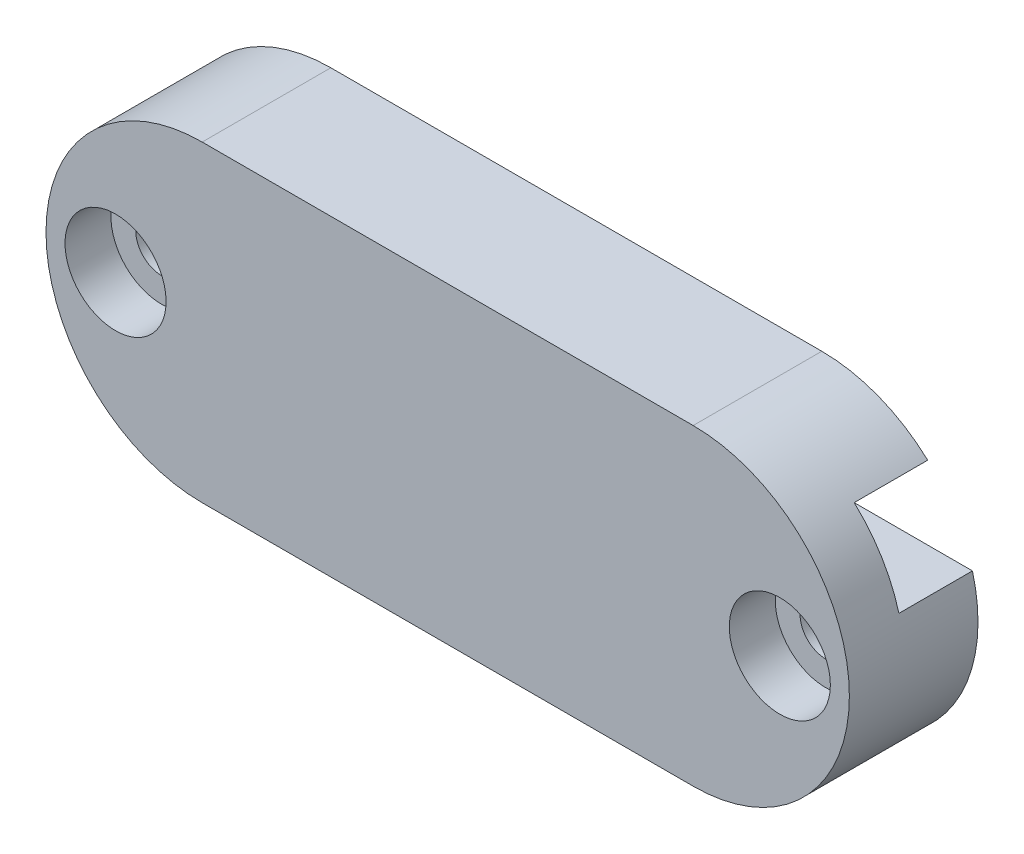
ISO-10303-21;
HEADER;
FILE_DESCRIPTION(('STEP AP214'),'2;1');
FILE_NAME('part.step','',(''),(''),'','','');
FILE_SCHEMA(('AUTOMOTIVE_DESIGN { 1 0 10303 214 1 1 1 1 }'));
ENDSEC;
DATA;
#1=APPLICATION_CONTEXT('core data for automotive mechanical design processes');
#2=APPLICATION_PROTOCOL_DEFINITION('international standard','automotive_design',2000,#1);
#3=PRODUCT_CONTEXT('',#1,'mechanical');
#4=PRODUCT('Part','Part','',(#3));
#5=PRODUCT_RELATED_PRODUCT_CATEGORY('part','',(#4));
#6=PRODUCT_DEFINITION_FORMATION('','',#4);
#7=PRODUCT_DEFINITION_CONTEXT('part definition',#1,'design');
#8=PRODUCT_DEFINITION('design','',#6,#7);
#9=PRODUCT_DEFINITION_SHAPE('','',#8);
#10=(LENGTH_UNIT() NAMED_UNIT(*) SI_UNIT(.MILLI.,.METRE.));
#11=(NAMED_UNIT(*) PLANE_ANGLE_UNIT() SI_UNIT($,.RADIAN.));
#12=(NAMED_UNIT(*) SI_UNIT($,.STERADIAN.) SOLID_ANGLE_UNIT());
#13=UNCERTAINTY_MEASURE_WITH_UNIT(LENGTH_MEASURE(1.E-05),#10,'distance_accuracy_value','');
#14=(GEOMETRIC_REPRESENTATION_CONTEXT(3) GLOBAL_UNCERTAINTY_ASSIGNED_CONTEXT((#13)) GLOBAL_UNIT_ASSIGNED_CONTEXT((#10,
#11,#12)) REPRESENTATION_CONTEXT('',''));
#15=CARTESIAN_POINT('',(0.,0.,0.));
#16=DIRECTION('',(0.,0.,1.));
#17=DIRECTION('',(1.,0.,0.));
#18=AXIS2_PLACEMENT_3D('',#15,#16,#17);
#19=CARTESIAN_POINT('',(-18.075,0.,7.));
#20=DIRECTION('',(0.,0.,-1.));
#21=DIRECTION('',(-1.,0.,0.));
#22=AXIS2_PLACEMENT_3D('',#19,#20,#21);
#23=CYLINDRICAL_SURFACE('',#22,1.4);
#24=CARTESIAN_POINT('',(-18.075,0.,0.));
#25=DIRECTION('',(0.,0.,1.));
#26=DIRECTION('',(1.,0.,0.));
#27=AXIS2_PLACEMENT_3D('',#24,#25,#26);
#28=CIRCLE('',#27,1.4);
#29=CARTESIAN_POINT('',(-16.675,0.,0.));
#30=VERTEX_POINT('',#29);
#31=EDGE_CURVE('E178',#30,#30,#28,.T.);
#32=ORIENTED_EDGE('',*,*,#31,.F.);
#33=EDGE_LOOP('',(#32));
#34=FACE_BOUND('',#33,.T.);
#35=CARTESIAN_POINT('',(-18.075,0.,4.5));
#36=DIRECTION('',(0.,0.,1.));
#37=DIRECTION('',(1.,0.,0.));
#38=AXIS2_PLACEMENT_3D('',#35,#36,#37);
#39=CIRCLE('',#38,1.4);
#40=CARTESIAN_POINT('',(-16.675,0.,4.5));
#41=VERTEX_POINT('',#40);
#42=EDGE_CURVE('E170',#41,#41,#39,.F.);
#43=ORIENTED_EDGE('',*,*,#42,.F.);
#44=EDGE_LOOP('',(#43));
#45=FACE_BOUND('',#44,.T.);
#46=ADVANCED_FACE('F37',(#34,#45),#23,.F.);
#47=CARTESIAN_POINT('',(18.075,0.,7.));
#48=DIRECTION('',(0.,0.,-1.));
#49=DIRECTION('',(-1.,0.,0.));
#50=AXIS2_PLACEMENT_3D('',#47,#48,#49);
#51=CYLINDRICAL_SURFACE('',#50,1.4);
#52=CARTESIAN_POINT('',(18.075,0.,0.));
#53=DIRECTION('',(0.,0.,1.));
#54=DIRECTION('',(1.,0.,0.));
#55=AXIS2_PLACEMENT_3D('',#52,#53,#54);
#56=CIRCLE('',#55,1.4);
#57=CARTESIAN_POINT('',(19.475,0.,0.));
#58=VERTEX_POINT('',#57);
#59=EDGE_CURVE('E127',#58,#58,#56,.T.);
#60=ORIENTED_EDGE('',*,*,#59,.F.);
#61=EDGE_LOOP('',(#60));
#62=FACE_BOUND('',#61,.T.);
#63=CARTESIAN_POINT('',(18.075,0.,4.5));
#64=DIRECTION('',(0.,0.,1.));
#65=DIRECTION('',(1.,0.,0.));
#66=AXIS2_PLACEMENT_3D('',#63,#64,#65);
#67=CIRCLE('',#66,1.4);
#68=CARTESIAN_POINT('',(19.475,0.,4.5));
#69=VERTEX_POINT('',#68);
#70=EDGE_CURVE('E167',#69,#69,#67,.F.);
#71=ORIENTED_EDGE('',*,*,#70,.F.);
#72=EDGE_LOOP('',(#71));
#73=FACE_BOUND('',#72,.T.);
#74=ADVANCED_FACE('F221',(#62,#73),#51,.F.);
#75=CARTESIAN_POINT('',(-13.3594073836164,0.,0.));
#76=DIRECTION('',(0.,0.,1.));
#77=DIRECTION('',(1.,0.,0.));
#78=AXIS2_PLACEMENT_3D('',#75,#76,#77);
#79=PLANE('',#78);
#80=ORIENTED_EDGE('',*,*,#59,.T.);
#81=EDGE_LOOP('',(#80));
#82=FACE_BOUND('',#81,.T.);
#83=ORIENTED_EDGE('',*,*,#31,.T.);
#84=EDGE_LOOP('',(#83));
#85=FACE_BOUND('',#84,.T.);
#86=CARTESIAN_POINT('',(-13.3594073836164,0.,0.));
#87=DIRECTION('',(0.,0.,1.));
#88=DIRECTION('',(1.,0.,0.));
#89=AXIS2_PLACEMENT_3D('',#86,#87,#88);
#90=CIRCLE('',#89,8.5);
#91=CARTESIAN_POINT('',(-21.5568708773496,2.24757475268617,0.));
#92=VERTEX_POINT('',#91);
#93=CARTESIAN_POINT('',(-13.3594073836164,-8.5,0.));
#94=VERTEX_POINT('',#93);
#95=EDGE_CURVE('E121',#92,#94,#90,.T.);
#96=ORIENTED_EDGE('',*,*,#95,.F.);
#97=DIRECTION('',(1.,0.,0.));
#98=VECTOR('',#97,1.);
#99=CARTESIAN_POINT('',(-13.3594073836164,2.24757475268617,0.));
#100=LINE('',#99,#98);
#101=CARTESIAN_POINT('',(21.5568708773496,2.24757475268617,0.));
#102=VERTEX_POINT('',#101);
#103=EDGE_CURVE('E46',#92,#102,#100,.T.);
#104=ORIENTED_EDGE('',*,*,#103,.T.);
#105=CARTESIAN_POINT('',(13.3594073836164,0.,0.));
#106=DIRECTION('',(0.,0.,-1.));
#107=DIRECTION('',(-1.,0.,0.));
#108=AXIS2_PLACEMENT_3D('',#105,#106,#107);
#109=CIRCLE('',#108,8.5);
#110=CARTESIAN_POINT('',(13.3594073836164,-8.5,0.));
#111=VERTEX_POINT('',#110);
#112=EDGE_CURVE('E149',#102,#111,#109,.T.);
#113=ORIENTED_EDGE('',*,*,#112,.T.);
#114=DIRECTION('',(1.,0.,0.));
#115=VECTOR('',#114,1.);
#116=CARTESIAN_POINT('',(-13.3594073836164,-8.5,0.));
#117=LINE('',#116,#115);
#118=EDGE_CURVE('E146',#94,#111,#117,.T.);
#119=ORIENTED_EDGE('',*,*,#118,.F.);
#120=EDGE_LOOP('',(#96,#104,#113,#119));
#121=FACE_BOUND('',#120,.T.);
#122=ADVANCED_FACE('F200',(#82,#85,#121),#79,.F.);
#123=CARTESIAN_POINT('',(-13.3594073836164,0.,7.));
#124=DIRECTION('',(0.,0.,-1.));
#125=DIRECTION('',(-1.,0.,0.));
#126=AXIS2_PLACEMENT_3D('',#123,#124,#125);
#127=CYLINDRICAL_SURFACE('',#126,8.5);
#128=CARTESIAN_POINT('',(-13.3594073836164,0.,4.));
#129=DIRECTION('',(0.,0.,1.));
#130=DIRECTION('',(0.,-1.,0.));
#131=AXIS2_PLACEMENT_3D('',#128,#129,#130);
#132=CIRCLE('',#131,8.5);
#133=CARTESIAN_POINT('',(-19.1228967528786,6.24757475268617,4.));
#134=VERTEX_POINT('',#133);
#135=CARTESIAN_POINT('',(-21.5568708773496,2.24757475268617,4.));
#136=VERTEX_POINT('',#135);
#137=EDGE_CURVE('E114',#134,#136,#132,.T.);
#138=ORIENTED_EDGE('',*,*,#137,.T.);
#139=DIRECTION('',(0.,0.,-1.));
#140=VECTOR('',#139,1.);
#141=CARTESIAN_POINT('',(-21.5568708773496,2.24757475268617,7.));
#142=LINE('',#141,#140);
#143=EDGE_CURVE('E122',#136,#92,#142,.T.);
#144=ORIENTED_EDGE('',*,*,#143,.T.);
#145=ORIENTED_EDGE('',*,*,#95,.T.);
#146=DIRECTION('',(0.,0.,-1.));
#147=VECTOR('',#146,1.);
#148=CARTESIAN_POINT('',(-13.3594073836164,-8.5,7.));
#149=LINE('',#148,#147);
#150=CARTESIAN_POINT('',(-13.3594073836164,-8.5,7.));
#151=VERTEX_POINT('',#150);
#152=EDGE_CURVE('E161',#151,#94,#149,.T.);
#153=ORIENTED_EDGE('',*,*,#152,.F.);
#154=CARTESIAN_POINT('',(-13.3594073836164,0.,7.));
#155=DIRECTION('',(0.,0.,1.));
#156=DIRECTION('',(1.,0.,0.));
#157=AXIS2_PLACEMENT_3D('',#154,#155,#156);
#158=CIRCLE('',#157,8.5);
#159=CARTESIAN_POINT('',(-13.3594073836164,8.5,7.));
#160=VERTEX_POINT('',#159);
#161=EDGE_CURVE('E136',#160,#151,#158,.T.);
#162=ORIENTED_EDGE('',*,*,#161,.F.);
#163=DIRECTION('',(0.,0.,-1.));
#164=VECTOR('',#163,1.);
#165=CARTESIAN_POINT('',(-13.3594073836164,8.5,7.));
#166=LINE('',#165,#164);
#167=CARTESIAN_POINT('',(-13.3594073836164,8.5,0.));
#168=VERTEX_POINT('',#167);
#169=EDGE_CURVE('E63',#160,#168,#166,.T.);
#170=ORIENTED_EDGE('',*,*,#169,.T.);
#171=CARTESIAN_POINT('',(-19.1228967528786,6.24757475268617,0.));
#172=VERTEX_POINT('',#171);
#173=EDGE_CURVE('E129',#168,#172,#90,.T.);
#174=ORIENTED_EDGE('',*,*,#173,.T.);
#175=DIRECTION('',(0.,0.,-1.));
#176=VECTOR('',#175,1.);
#177=CARTESIAN_POINT('',(-19.1228967528786,6.24757475268617,7.));
#178=LINE('',#177,#176);
#179=EDGE_CURVE('E54',#172,#134,#178,.F.);
#180=ORIENTED_EDGE('',*,*,#179,.T.);
#181=EDGE_LOOP('',(#138,#144,#145,#153,#162,#170,#174,#180));
#182=FACE_BOUND('',#181,.T.);
#183=ADVANCED_FACE('F39',(#182),#127,.T.);
#184=CARTESIAN_POINT('',(-13.3594073836164,-8.5,7.));
#185=DIRECTION('',(0.,1.,0.));
#186=DIRECTION('',(0.,0.,1.));
#187=AXIS2_PLACEMENT_3D('',#184,#185,#186);
#188=PLANE('',#187);
#189=ORIENTED_EDGE('',*,*,#118,.T.);
#190=DIRECTION('',(0.,0.,-1.));
#191=VECTOR('',#190,1.);
#192=CARTESIAN_POINT('',(13.3594073836164,-8.5,7.));
#193=LINE('',#192,#191);
#194=CARTESIAN_POINT('',(13.3594073836164,-8.5,7.));
#195=VERTEX_POINT('',#194);
#196=EDGE_CURVE('E158',#195,#111,#193,.T.);
#197=ORIENTED_EDGE('',*,*,#196,.F.);
#198=DIRECTION('',(1.,0.,0.));
#199=VECTOR('',#198,1.);
#200=CARTESIAN_POINT('',(-13.3594073836164,-8.5,7.));
#201=LINE('',#200,#199);
#202=EDGE_CURVE('E90',#151,#195,#201,.T.);
#203=ORIENTED_EDGE('',*,*,#202,.F.);
#204=ORIENTED_EDGE('',*,*,#152,.T.);
#205=EDGE_LOOP('',(#189,#197,#203,#204));
#206=FACE_BOUND('',#205,.T.);
#207=ADVANCED_FACE('F203',(#206),#188,.F.);
#208=CARTESIAN_POINT('',(13.3594073836164,0.,7.));
#209=DIRECTION('',(0.,0.,-1.));
#210=DIRECTION('',(-1.,0.,0.));
#211=AXIS2_PLACEMENT_3D('',#208,#209,#210);
#212=CYLINDRICAL_SURFACE('',#211,8.5);
#213=DIRECTION('',(0.,0.,-1.));
#214=VECTOR('',#213,1.);
#215=CARTESIAN_POINT('',(21.5568708773496,2.24757475268617,7.));
#216=LINE('',#215,#214);
#217=CARTESIAN_POINT('',(21.5568708773496,2.24757475268617,4.));
#218=VERTEX_POINT('',#217);
#219=EDGE_CURVE('E130',#218,#102,#216,.T.);
#220=ORIENTED_EDGE('',*,*,#219,.F.);
#221=CARTESIAN_POINT('',(13.3594073836164,0.,4.));
#222=DIRECTION('',(0.,0.,1.));
#223=DIRECTION('',(0.,-1.,0.));
#224=AXIS2_PLACEMENT_3D('',#221,#222,#223);
#225=CIRCLE('',#224,8.5);
#226=CARTESIAN_POINT('',(19.1228967528786,6.24757475268617,4.));
#227=VERTEX_POINT('',#226);
#228=EDGE_CURVE('E11',#227,#218,#225,.F.);
#229=ORIENTED_EDGE('',*,*,#228,.F.);
#230=DIRECTION('',(0.,0.,-1.));
#231=VECTOR('',#230,1.);
#232=CARTESIAN_POINT('',(19.1228967528786,6.24757475268617,7.));
#233=LINE('',#232,#231);
#234=CARTESIAN_POINT('',(19.1228967528786,6.24757475268617,0.));
#235=VERTEX_POINT('',#234);
#236=EDGE_CURVE('E126',#235,#227,#233,.F.);
#237=ORIENTED_EDGE('',*,*,#236,.F.);
#238=CARTESIAN_POINT('',(13.3594073836164,8.5,0.));
#239=VERTEX_POINT('',#238);
#240=EDGE_CURVE('E150',#239,#235,#109,.T.);
#241=ORIENTED_EDGE('',*,*,#240,.F.);
#242=DIRECTION('',(0.,0.,-1.));
#243=VECTOR('',#242,1.);
#244=CARTESIAN_POINT('',(13.3594073836164,8.5,7.));
#245=LINE('',#244,#243);
#246=CARTESIAN_POINT('',(13.3594073836164,8.5,7.));
#247=VERTEX_POINT('',#246);
#248=EDGE_CURVE('E156',#247,#239,#245,.T.);
#249=ORIENTED_EDGE('',*,*,#248,.F.);
#250=CARTESIAN_POINT('',(13.3594073836164,0.,7.));
#251=DIRECTION('',(0.,0.,-1.));
#252=DIRECTION('',(-1.,0.,0.));
#253=AXIS2_PLACEMENT_3D('',#250,#251,#252);
#254=CIRCLE('',#253,8.5);
#255=EDGE_CURVE('E140',#247,#195,#254,.T.);
#256=ORIENTED_EDGE('',*,*,#255,.T.);
#257=ORIENTED_EDGE('',*,*,#196,.T.);
#258=ORIENTED_EDGE('',*,*,#112,.F.);
#259=EDGE_LOOP('',(#220,#229,#237,#241,#249,#256,#257,#258));
#260=FACE_BOUND('',#259,.T.);
#261=ADVANCED_FACE('F196',(#260),#212,.T.);
#262=CARTESIAN_POINT('',(-13.3594073836164,8.5,7.));
#263=DIRECTION('',(0.,1.,0.));
#264=DIRECTION('',(0.,0.,1.));
#265=AXIS2_PLACEMENT_3D('',#262,#263,#264);
#266=PLANE('',#265);
#267=DIRECTION('',(1.,0.,0.));
#268=VECTOR('',#267,1.);
#269=CARTESIAN_POINT('',(-13.3594073836164,8.5,0.));
#270=LINE('',#269,#268);
#271=EDGE_CURVE('E138',#168,#239,#270,.T.);
#272=ORIENTED_EDGE('',*,*,#271,.F.);
#273=ORIENTED_EDGE('',*,*,#169,.F.);
#274=DIRECTION('',(1.,0.,0.));
#275=VECTOR('',#274,1.);
#276=CARTESIAN_POINT('',(-13.3594073836164,8.5,7.));
#277=LINE('',#276,#275);
#278=EDGE_CURVE('E143',#160,#247,#277,.T.);
#279=ORIENTED_EDGE('',*,*,#278,.T.);
#280=ORIENTED_EDGE('',*,*,#248,.T.);
#281=EDGE_LOOP('',(#272,#273,#279,#280));
#282=FACE_BOUND('',#281,.T.);
#283=ADVANCED_FACE('F208',(#282),#266,.T.);
#284=CARTESIAN_POINT('',(-13.3594073836164,0.,7.));
#285=DIRECTION('',(0.,0.,1.));
#286=DIRECTION('',(1.,0.,0.));
#287=AXIS2_PLACEMENT_3D('',#284,#285,#286);
#288=PLANE('',#287);
#289=CARTESIAN_POINT('',(-18.075,0.,7.));
#290=DIRECTION('',(0.,0.,1.));
#291=DIRECTION('',(1.,0.,0.));
#292=AXIS2_PLACEMENT_3D('',#289,#290,#291);
#293=CIRCLE('',#292,2.75);
#294=CARTESIAN_POINT('',(-15.325,0.,7.));
#295=VERTEX_POINT('',#294);
#296=EDGE_CURVE('E41',#295,#295,#293,.F.);
#297=ORIENTED_EDGE('',*,*,#296,.T.);
#298=EDGE_LOOP('',(#297));
#299=FACE_BOUND('',#298,.T.);
#300=CARTESIAN_POINT('',(18.075,0.,7.));
#301=DIRECTION('',(0.,0.,1.));
#302=DIRECTION('',(1.,0.,0.));
#303=AXIS2_PLACEMENT_3D('',#300,#301,#302);
#304=CIRCLE('',#303,2.75);
#305=CARTESIAN_POINT('',(20.825,0.,7.));
#306=VERTEX_POINT('',#305);
#307=EDGE_CURVE('E173',#306,#306,#304,.F.);
#308=ORIENTED_EDGE('',*,*,#307,.T.);
#309=EDGE_LOOP('',(#308));
#310=FACE_BOUND('',#309,.T.);
#311=ORIENTED_EDGE('',*,*,#161,.T.);
#312=ORIENTED_EDGE('',*,*,#202,.T.);
#313=ORIENTED_EDGE('',*,*,#255,.F.);
#314=ORIENTED_EDGE('',*,*,#278,.F.);
#315=EDGE_LOOP('',(#311,#312,#313,#314));
#316=FACE_BOUND('',#315,.T.);
#317=ADVANCED_FACE('F207',(#299,#310,#316),#288,.T.);
#318=ORIENTED_EDGE('',*,*,#240,.T.);
#319=DIRECTION('',(-1.,0.,0.));
#320=VECTOR('',#319,1.);
#321=CARTESIAN_POINT('',(-13.3594073836164,6.24757475268617,0.));
#322=LINE('',#321,#320);
#323=EDGE_CURVE('E163',#235,#172,#322,.T.);
#324=ORIENTED_EDGE('',*,*,#323,.T.);
#325=ORIENTED_EDGE('',*,*,#173,.F.);
#326=ORIENTED_EDGE('',*,*,#271,.T.);
#327=EDGE_LOOP('',(#318,#324,#325,#326));
#328=FACE_BOUND('',#327,.T.);
#329=ADVANCED_FACE('F210',(#328),#79,.F.);
#330=CARTESIAN_POINT('',(-21.8594073836164,6.24757475268617,4.));
#331=DIRECTION('',(0.,0.,1.));
#332=DIRECTION('',(0.,-1.,0.));
#333=AXIS2_PLACEMENT_3D('',#330,#331,#332);
#334=PLANE('',#333);
#335=DIRECTION('',(1.,0.,0.));
#336=VECTOR('',#335,1.);
#337=CARTESIAN_POINT('',(-21.8594073836164,6.24757475268617,4.));
#338=LINE('',#337,#336);
#339=EDGE_CURVE('E116',#134,#227,#338,.T.);
#340=ORIENTED_EDGE('',*,*,#339,.T.);
#341=ORIENTED_EDGE('',*,*,#228,.T.);
#342=DIRECTION('',(1.,0.,0.));
#343=VECTOR('',#342,1.);
#344=CARTESIAN_POINT('',(-21.8594073836164,2.24757475268617,4.));
#345=LINE('',#344,#343);
#346=EDGE_CURVE('E119',#136,#218,#345,.T.);
#347=ORIENTED_EDGE('',*,*,#346,.F.);
#348=ORIENTED_EDGE('',*,*,#137,.F.);
#349=EDGE_LOOP('',(#340,#341,#347,#348));
#350=FACE_BOUND('',#349,.T.);
#351=ADVANCED_FACE('F115',(#350),#334,.F.);
#352=CARTESIAN_POINT('',(-21.8594073836164,2.24757475268617,4.));
#353=DIRECTION('',(0.,-1.,0.));
#354=DIRECTION('',(0.,0.,-1.));
#355=AXIS2_PLACEMENT_3D('',#352,#353,#354);
#356=PLANE('',#355);
#357=ORIENTED_EDGE('',*,*,#346,.T.);
#358=ORIENTED_EDGE('',*,*,#219,.T.);
#359=ORIENTED_EDGE('',*,*,#103,.F.);
#360=ORIENTED_EDGE('',*,*,#143,.F.);
#361=EDGE_LOOP('',(#357,#358,#359,#360));
#362=FACE_BOUND('',#361,.T.);
#363=ADVANCED_FACE('F193',(#362),#356,.F.);
#364=CARTESIAN_POINT('',(-21.8594073836164,6.24757475268617,4.));
#365=DIRECTION('',(0.,1.,0.));
#366=DIRECTION('',(0.,0.,1.));
#367=AXIS2_PLACEMENT_3D('',#364,#365,#366);
#368=PLANE('',#367);
#369=ORIENTED_EDGE('',*,*,#323,.F.);
#370=ORIENTED_EDGE('',*,*,#236,.T.);
#371=ORIENTED_EDGE('',*,*,#339,.F.);
#372=ORIENTED_EDGE('',*,*,#179,.F.);
#373=EDGE_LOOP('',(#369,#370,#371,#372));
#374=FACE_BOUND('',#373,.T.);
#375=ADVANCED_FACE('F124',(#374),#368,.F.);
#376=CARTESIAN_POINT('',(18.075,0.,4.5));
#377=DIRECTION('',(0.,0.,1.));
#378=DIRECTION('',(1.,0.,0.));
#379=AXIS2_PLACEMENT_3D('',#376,#377,#378);
#380=PLANE('',#379);
#381=CARTESIAN_POINT('',(18.075,0.,4.5));
#382=DIRECTION('',(0.,0.,1.));
#383=DIRECTION('',(1.,0.,0.));
#384=AXIS2_PLACEMENT_3D('',#381,#382,#383);
#385=CIRCLE('',#384,2.75);
#386=CARTESIAN_POINT('',(20.825,0.,4.5));
#387=VERTEX_POINT('',#386);
#388=EDGE_CURVE('E188',#387,#387,#385,.T.);
#389=ORIENTED_EDGE('',*,*,#388,.T.);
#390=EDGE_LOOP('',(#389));
#391=FACE_BOUND('',#390,.T.);
#392=ORIENTED_EDGE('',*,*,#70,.T.);
#393=EDGE_LOOP('',(#392));
#394=FACE_BOUND('',#393,.T.);
#395=ADVANCED_FACE('F237',(#391,#394),#380,.T.);
#396=CARTESIAN_POINT('',(18.075,0.,7.000012));
#397=DIRECTION('',(0.,0.,-1.));
#398=DIRECTION('',(-1.,0.,0.));
#399=AXIS2_PLACEMENT_3D('',#396,#397,#398);
#400=CYLINDRICAL_SURFACE('',#399,2.75);
#401=ORIENTED_EDGE('',*,*,#307,.F.);
#402=EDGE_LOOP('',(#401));
#403=FACE_BOUND('',#402,.T.);
#404=ORIENTED_EDGE('',*,*,#388,.F.);
#405=EDGE_LOOP('',(#404));
#406=FACE_BOUND('',#405,.T.);
#407=ADVANCED_FACE('F241',(#403,#406),#400,.F.);
#408=CARTESIAN_POINT('',(-18.075,0.,4.5));
#409=DIRECTION('',(0.,0.,1.));
#410=DIRECTION('',(1.,0.,0.));
#411=AXIS2_PLACEMENT_3D('',#408,#409,#410);
#412=PLANE('',#411);
#413=CARTESIAN_POINT('',(-18.075,0.,4.5));
#414=DIRECTION('',(0.,0.,1.));
#415=DIRECTION('',(1.,0.,0.));
#416=AXIS2_PLACEMENT_3D('',#413,#414,#415);
#417=CIRCLE('',#416,2.75);
#418=CARTESIAN_POINT('',(-15.325,0.,4.5));
#419=VERTEX_POINT('',#418);
#420=EDGE_CURVE('E171',#419,#419,#417,.T.);
#421=ORIENTED_EDGE('',*,*,#420,.T.);
#422=EDGE_LOOP('',(#421));
#423=FACE_BOUND('',#422,.T.);
#424=ORIENTED_EDGE('',*,*,#42,.T.);
#425=EDGE_LOOP('',(#424));
#426=FACE_BOUND('',#425,.T.);
#427=ADVANCED_FACE('F246',(#423,#426),#412,.T.);
#428=CARTESIAN_POINT('',(-18.075,0.,7.000012));
#429=DIRECTION('',(0.,0.,-1.));
#430=DIRECTION('',(-1.,0.,0.));
#431=AXIS2_PLACEMENT_3D('',#428,#429,#430);
#432=CYLINDRICAL_SURFACE('',#431,2.75);
#433=ORIENTED_EDGE('',*,*,#296,.F.);
#434=EDGE_LOOP('',(#433));
#435=FACE_BOUND('',#434,.T.);
#436=ORIENTED_EDGE('',*,*,#420,.F.);
#437=EDGE_LOOP('',(#436));
#438=FACE_BOUND('',#437,.T.);
#439=ADVANCED_FACE('F252',(#435,#438),#432,.F.);
#440=CLOSED_SHELL('',(#46,#74,#122,#183,#207,#261,#283,#317,#329,#351,#363,#375,#395,#407,#427,#439));
#441=MANIFOLD_SOLID_BREP('B2',#440);
#442=ADVANCED_BREP_SHAPE_REPRESENTATION('',(#18,#441),#14);
#443=SHAPE_DEFINITION_REPRESENTATION(#9,#442);
ENDSEC;
END-ISO-10303-21;
